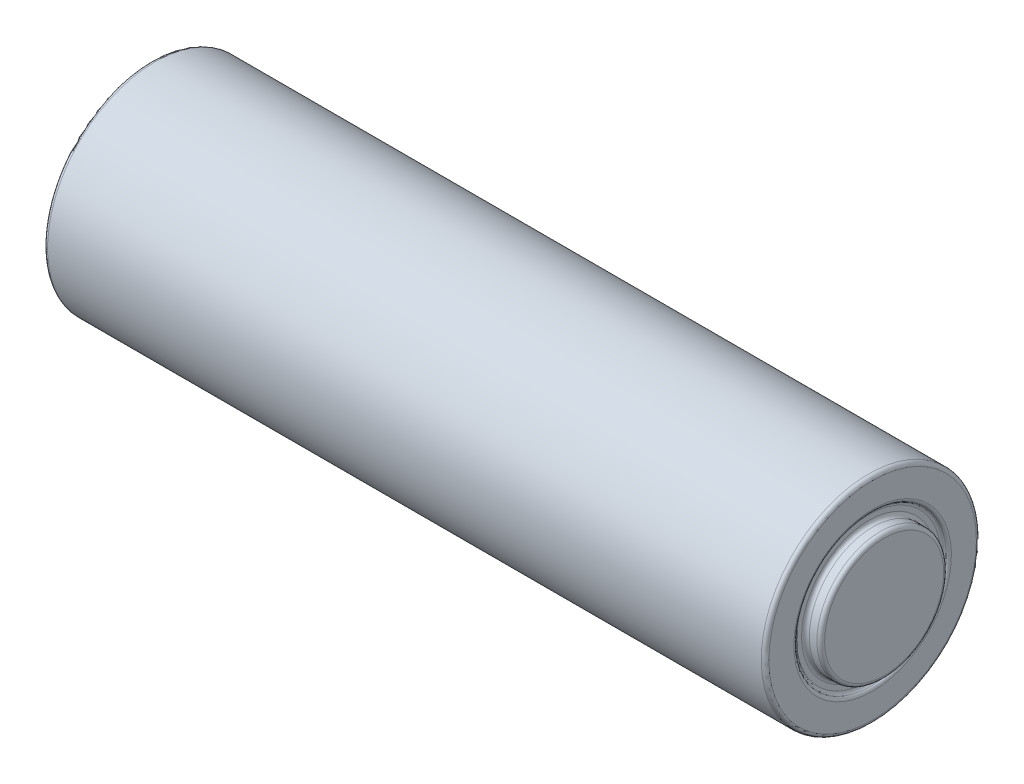
ISO-10303-21;
HEADER;
FILE_DESCRIPTION(('STEP AP214'),'2;1');
FILE_NAME('part.step','',(''),(''),'','','');
FILE_SCHEMA(('AUTOMOTIVE_DESIGN { 1 0 10303 214 1 1 1 1 }'));
ENDSEC;
DATA;
#1=APPLICATION_CONTEXT('core data for automotive mechanical design processes');
#2=APPLICATION_PROTOCOL_DEFINITION('international standard','automotive_design',2000,#1);
#3=PRODUCT_CONTEXT('',#1,'mechanical');
#4=PRODUCT('Part','Part','',(#3));
#5=PRODUCT_RELATED_PRODUCT_CATEGORY('part','',(#4));
#6=PRODUCT_DEFINITION_FORMATION('','',#4);
#7=PRODUCT_DEFINITION_CONTEXT('part definition',#1,'design');
#8=PRODUCT_DEFINITION('design','',#6,#7);
#9=PRODUCT_DEFINITION_SHAPE('','',#8);
#10=(LENGTH_UNIT() NAMED_UNIT(*) SI_UNIT(.MILLI.,.METRE.));
#11=(NAMED_UNIT(*) PLANE_ANGLE_UNIT() SI_UNIT($,.RADIAN.));
#12=(NAMED_UNIT(*) SI_UNIT($,.STERADIAN.) SOLID_ANGLE_UNIT());
#13=UNCERTAINTY_MEASURE_WITH_UNIT(LENGTH_MEASURE(1.E-05),#10,'distance_accuracy_value','');
#14=(GEOMETRIC_REPRESENTATION_CONTEXT(3) GLOBAL_UNCERTAINTY_ASSIGNED_CONTEXT((#13)) GLOBAL_UNIT_ASSIGNED_CONTEXT((#10,
#11,#12)) REPRESENTATION_CONTEXT('',''));
#15=CARTESIAN_POINT('',(0.,0.,0.));
#16=DIRECTION('',(0.,0.,1.));
#17=DIRECTION('',(1.,0.,0.));
#18=AXIS2_PLACEMENT_3D('',#15,#16,#17);
#19=CARTESIAN_POINT('',(47.4218,0.,0.));
#20=DIRECTION('',(1.,0.,0.));
#21=DIRECTION('',(0.,1.,0.));
#22=AXIS2_PLACEMENT_3D('',#19,#20,#21);
#23=PLANE('',#22);
#24=CARTESIAN_POINT('',(47.4218,0.,0.));
#25=DIRECTION('',(1.,0.,0.));
#26=DIRECTION('',(0.,1.,0.));
#27=AXIS2_PLACEMENT_3D('',#24,#25,#26);
#28=CIRCLE('',#27,4.7670590948775);
#29=CARTESIAN_POINT('',(47.4218,4.76705909487749,0.));
#30=VERTEX_POINT('',#29);
#31=EDGE_CURVE('E41',#30,#30,#28,.T.);
#32=ORIENTED_EDGE('',*,*,#31,.T.);
#33=EDGE_LOOP('',(#32));
#34=FACE_BOUND('',#33,.T.);
#35=CARTESIAN_POINT('',(47.4218,0.,0.));
#36=DIRECTION('',(1.,0.,0.));
#37=DIRECTION('',(0.,1.,0.));
#38=AXIS2_PLACEMENT_3D('',#35,#36,#37);
#39=CIRCLE('',#38,4.445);
#40=CARTESIAN_POINT('',(47.4218,4.44499999999999,0.));
#41=VERTEX_POINT('',#40);
#42=EDGE_CURVE('E45',#41,#41,#39,.F.);
#43=ORIENTED_EDGE('',*,*,#42,.T.);
#44=EDGE_LOOP('',(#43));
#45=FACE_BOUND('',#44,.T.);
#46=ADVANCED_FACE('F34',(#34,#45),#23,.T.);
#47=CARTESIAN_POINT('',(0.254,0.,0.));
#48=DIRECTION('',(-1.,0.,0.));
#49=DIRECTION('',(0.,-1.,0.));
#50=AXIS2_PLACEMENT_3D('',#47,#48,#49);
#51=PLANE('',#50);
#52=CARTESIAN_POINT('',(0.254,0.,0.));
#53=DIRECTION('',(-1.,0.,0.));
#54=DIRECTION('',(0.,-1.,0.));
#55=AXIS2_PLACEMENT_3D('',#52,#53,#54);
#56=CIRCLE('',#55,5.0718590948775);
#57=CARTESIAN_POINT('',(0.253999999999999,-5.0718590948775,0.));
#58=VERTEX_POINT('',#57);
#59=EDGE_CURVE('E72',#58,#58,#56,.T.);
#60=ORIENTED_EDGE('',*,*,#59,.T.);
#61=EDGE_LOOP('',(#60));
#62=FACE_BOUND('',#61,.T.);
#63=CARTESIAN_POINT('',(0.254,0.,0.));
#64=DIRECTION('',(-1.,0.,0.));
#65=DIRECTION('',(0.,-1.,0.));
#66=AXIS2_PLACEMENT_3D('',#63,#64,#65);
#67=CIRCLE('',#66,2.921);
#68=CARTESIAN_POINT('',(0.253999999999999,-2.921,0.));
#69=VERTEX_POINT('',#68);
#70=EDGE_CURVE('E75',#69,#69,#67,.F.);
#71=ORIENTED_EDGE('',*,*,#70,.T.);
#72=EDGE_LOOP('',(#71));
#73=FACE_BOUND('',#72,.T.);
#74=ADVANCED_FACE('F116',(#62,#73),#51,.T.);
#75=CARTESIAN_POINT('',(0.,7.11199999999999,0.));
#76=DIRECTION('',(1.,0.,0.));
#77=DIRECTION('',(0.,1.,0.));
#78=AXIS2_PLACEMENT_3D('',#75,#76,#77);
#79=PLANE('',#78);
#80=CARTESIAN_POINT('',(0.,0.,0.));
#81=DIRECTION('',(1.,0.,0.));
#82=DIRECTION('',(0.,1.,0.));
#83=AXIS2_PLACEMENT_3D('',#80,#81,#82);
#84=CIRCLE('',#83,6.858);
#85=CARTESIAN_POINT('',(0.,6.858,0.));
#86=VERTEX_POINT('',#85);
#87=EDGE_CURVE('E90',#86,#86,#84,.F.);
#88=ORIENTED_EDGE('',*,*,#87,.T.);
#89=EDGE_LOOP('',(#88));
#90=FACE_BOUND('',#89,.T.);
#91=CARTESIAN_POINT('',(0.,0.,0.));
#92=DIRECTION('',(1.,0.,0.));
#93=DIRECTION('',(0.,1.,0.));
#94=AXIS2_PLACEMENT_3D('',#91,#92,#93);
#95=CIRCLE('',#94,5.5118);
#96=CARTESIAN_POINT('',(0.,5.5118,0.));
#97=VERTEX_POINT('',#96);
#98=EDGE_CURVE('E93',#97,#97,#95,.T.);
#99=ORIENTED_EDGE('',*,*,#98,.T.);
#100=EDGE_LOOP('',(#99));
#101=FACE_BOUND('',#100,.T.);
#102=ADVANCED_FACE('F97',(#90,#101),#79,.F.);
#103=CARTESIAN_POINT('',(0.,0.,0.));
#104=DIRECTION('',(-1.,0.,0.));
#105=DIRECTION('',(0.,-1.,0.));
#106=AXIS2_PLACEMENT_3D('',#103,#104,#105);
#107=CYLINDRICAL_SURFACE('',#106,7.11199999999999);
#108=CARTESIAN_POINT('',(47.4218,0.,0.));
#109=DIRECTION('',(-1.,0.,0.));
#110=DIRECTION('',(0.,-1.,0.));
#111=AXIS2_PLACEMENT_3D('',#108,#109,#110);
#112=CIRCLE('',#111,7.11199999999999);
#113=CARTESIAN_POINT('',(47.4218,-7.11200000000001,0.));
#114=VERTEX_POINT('',#113);
#115=EDGE_CURVE('E66',#114,#114,#112,.T.);
#116=ORIENTED_EDGE('',*,*,#115,.T.);
#117=EDGE_LOOP('',(#116));
#118=FACE_BOUND('',#117,.T.);
#119=CARTESIAN_POINT('',(0.254,0.,0.));
#120=DIRECTION('',(1.,0.,0.));
#121=DIRECTION('',(0.,1.,0.));
#122=AXIS2_PLACEMENT_3D('',#119,#120,#121);
#123=CIRCLE('',#122,7.11199999999999);
#124=CARTESIAN_POINT('',(0.254000000000002,7.11199999999999,0.));
#125=VERTEX_POINT('',#124);
#126=EDGE_CURVE('E87',#125,#125,#123,.T.);
#127=ORIENTED_EDGE('',*,*,#126,.T.);
#128=EDGE_LOOP('',(#127));
#129=FACE_BOUND('',#128,.T.);
#130=ADVANCED_FACE('F139',(#118,#129),#107,.T.);
#131=CARTESIAN_POINT('',(47.6758,0.,0.));
#132=DIRECTION('',(-1.,0.,0.));
#133=DIRECTION('',(0.,-1.,0.));
#134=AXIS2_PLACEMENT_3D('',#131,#132,#133);
#135=PLANE('',#134);
#136=CARTESIAN_POINT('',(47.6758,0.,0.));
#137=DIRECTION('',(-1.,0.,0.));
#138=DIRECTION('',(0.,-1.,0.));
#139=AXIS2_PLACEMENT_3D('',#136,#137,#138);
#140=CIRCLE('',#139,6.858);
#141=CARTESIAN_POINT('',(47.6758,-6.85800000000001,0.));
#142=VERTEX_POINT('',#141);
#143=EDGE_CURVE('E60',#142,#142,#140,.F.);
#144=ORIENTED_EDGE('',*,*,#143,.T.);
#145=EDGE_LOOP('',(#144));
#146=FACE_BOUND('',#145,.T.);
#147=CARTESIAN_POINT('',(47.6758,0.,0.));
#148=DIRECTION('',(-1.,0.,0.));
#149=DIRECTION('',(0.,-1.,0.));
#150=AXIS2_PLACEMENT_3D('',#147,#148,#149);
#151=CIRCLE('',#150,5.207);
#152=CARTESIAN_POINT('',(47.6758,-5.20700000000001,0.));
#153=VERTEX_POINT('',#152);
#154=EDGE_CURVE('E63',#153,#153,#151,.T.);
#155=ORIENTED_EDGE('',*,*,#154,.T.);
#156=EDGE_LOOP('',(#155));
#157=FACE_BOUND('',#156,.T.);
#158=ADVANCED_FACE('F134',(#146,#157),#135,.F.);
#159=CARTESIAN_POINT('',(-1.27,0.,0.));
#160=DIRECTION('',(1.,0.,0.));
#161=DIRECTION('',(0.,1.,0.));
#162=AXIS2_PLACEMENT_3D('',#159,#160,#161);
#163=CYLINDRICAL_SURFACE('',#162,2.667);
#164=CARTESIAN_POINT('',(-1.016,0.,0.));
#165=DIRECTION('',(-1.,0.,0.));
#166=DIRECTION('',(0.,-1.,0.));
#167=AXIS2_PLACEMENT_3D('',#164,#165,#166);
#168=CIRCLE('',#167,2.667);
#169=CARTESIAN_POINT('',(-1.016,2.667,0.));
#170=VERTEX_POINT('',#169);
#171=EDGE_CURVE('E78',#170,#170,#168,.F.);
#172=CARTESIAN_POINT('',(0.,0.,0.));
#173=DIRECTION('',(-1.,0.,0.));
#174=DIRECTION('',(0.,-1.,0.));
#175=AXIS2_PLACEMENT_3D('',#172,#173,#174);
#176=CIRCLE('',#175,2.667);
#177=CARTESIAN_POINT('',(0.,2.667,0.));
#178=VERTEX_POINT('',#177);
#179=EDGE_CURVE('E81',#178,#178,#176,.T.);
#180=CARTESIAN_POINT('',(-1.016,2.667,0.));
#181=CARTESIAN_POINT('',(-1.00541666666667,2.667,0.));
#182=CARTESIAN_POINT('',(-0.994833333333333,2.667,0.));
#183=CARTESIAN_POINT('',(-0.973666666666666,2.667,0.));
#184=CARTESIAN_POINT('',(-0.963083333333333,2.667,0.));
#185=CARTESIAN_POINT('',(-0.941916666666666,2.667,0.));
#186=CARTESIAN_POINT('',(-0.931333333333333,2.667,0.));
#187=CARTESIAN_POINT('',(-0.910166666666666,2.667,0.));
#188=CARTESIAN_POINT('',(-0.899583333333333,2.667,0.));
#189=CARTESIAN_POINT('',(-0.878416666666666,2.667,0.));
#190=CARTESIAN_POINT('',(-0.867833333333333,2.667,0.));
#191=CARTESIAN_POINT('',(-0.846666666666666,2.667,0.));
#192=CARTESIAN_POINT('',(-0.836083333333333,2.667,0.));
#193=CARTESIAN_POINT('',(-0.814916666666666,2.667,0.));
#194=CARTESIAN_POINT('',(-0.804333333333333,2.667,0.));
#195=CARTESIAN_POINT('',(-0.783166666666666,2.667,0.));
#196=CARTESIAN_POINT('',(-0.772583333333333,2.667,0.));
#197=CARTESIAN_POINT('',(-0.751416666666666,2.667,0.));
#198=CARTESIAN_POINT('',(-0.740833333333333,2.667,0.));
#199=CARTESIAN_POINT('',(-0.719666666666666,2.667,0.));
#200=CARTESIAN_POINT('',(-0.709083333333333,2.667,0.));
#201=CARTESIAN_POINT('',(-0.687916666666666,2.667,0.));
#202=CARTESIAN_POINT('',(-0.677333333333333,2.667,0.));
#203=CARTESIAN_POINT('',(-0.656166666666666,2.667,0.));
#204=CARTESIAN_POINT('',(-0.645583333333333,2.667,0.));
#205=CARTESIAN_POINT('',(-0.624416666666666,2.667,0.));
#206=CARTESIAN_POINT('',(-0.613833333333333,2.667,0.));
#207=CARTESIAN_POINT('',(-0.592666666666666,2.667,0.));
#208=CARTESIAN_POINT('',(-0.582083333333333,2.667,0.));
#209=CARTESIAN_POINT('',(-0.560916666666666,2.667,0.));
#210=CARTESIAN_POINT('',(-0.550333333333333,2.667,0.));
#211=CARTESIAN_POINT('',(-0.529166666666666,2.667,0.));
#212=CARTESIAN_POINT('',(-0.518583333333333,2.667,0.));
#213=CARTESIAN_POINT('',(-0.497416666666666,2.667,0.));
#214=CARTESIAN_POINT('',(-0.486833333333333,2.667,0.));
#215=CARTESIAN_POINT('',(-0.465666666666666,2.667,0.));
#216=CARTESIAN_POINT('',(-0.455083333333333,2.667,0.));
#217=CARTESIAN_POINT('',(-0.433916666666666,2.667,0.));
#218=CARTESIAN_POINT('',(-0.423333333333333,2.667,0.));
#219=CARTESIAN_POINT('',(-0.402166666666666,2.667,0.));
#220=CARTESIAN_POINT('',(-0.391583333333333,2.667,0.));
#221=CARTESIAN_POINT('',(-0.370416666666666,2.667,0.));
#222=CARTESIAN_POINT('',(-0.359833333333333,2.667,0.));
#223=CARTESIAN_POINT('',(-0.338666666666666,2.667,0.));
#224=CARTESIAN_POINT('',(-0.328083333333333,2.667,0.));
#225=CARTESIAN_POINT('',(-0.306916666666666,2.667,0.));
#226=CARTESIAN_POINT('',(-0.296333333333333,2.667,0.));
#227=CARTESIAN_POINT('',(-0.275166666666666,2.667,0.));
#228=CARTESIAN_POINT('',(-0.264583333333333,2.667,0.));
#229=CARTESIAN_POINT('',(-0.243416666666666,2.667,0.));
#230=CARTESIAN_POINT('',(-0.232833333333333,2.667,0.));
#231=CARTESIAN_POINT('',(-0.211666666666666,2.667,0.));
#232=CARTESIAN_POINT('',(-0.201083333333333,2.667,0.));
#233=CARTESIAN_POINT('',(-0.179916666666666,2.667,0.));
#234=CARTESIAN_POINT('',(-0.169333333333333,2.667,0.));
#235=CARTESIAN_POINT('',(-0.148166666666666,2.667,0.));
#236=CARTESIAN_POINT('',(-0.137583333333333,2.667,0.));
#237=CARTESIAN_POINT('',(-0.116416666666666,2.667,0.));
#238=CARTESIAN_POINT('',(-0.105833333333333,2.667,0.));
#239=CARTESIAN_POINT('',(-0.0846666666666661,2.667,0.));
#240=CARTESIAN_POINT('',(-0.0740833333333328,2.667,0.));
#241=CARTESIAN_POINT('',(-0.0529166666666662,2.667,0.));
#242=CARTESIAN_POINT('',(-0.042333333333333,2.667,0.));
#243=CARTESIAN_POINT('',(-0.0211666666666663,2.667,0.));
#244=CARTESIAN_POINT('',(-0.0105833333333329,2.667,0.));
#245=CARTESIAN_POINT('',(0.,2.667,0.));
#246=B_SPLINE_CURVE_WITH_KNOTS('',3,(#180,#181,#182,#183,#184,#185,#186,#187,#188,#189,#190,
#191,#192,#193,#194,#195,#196,#197,#198,#199,#200,#201,#202,#203,#204,#205,#206,#207,#208,#209,
#210,#211,#212,#213,#214,#215,#216,#217,#218,#219,#220,#221,#222,#223,#224,#225,#226,#227,#228,
#229,#230,#231,#232,#233,#234,#235,#236,#237,#238,#239,#240,#241,#242,#243,#244,#245),
.UNSPECIFIED.,.F.,.F.,(4,2,2,2,2,2,2,2,2,2,2,2,2,2,2,2,2,2,2,2,2,2,2,2,2,2,2,2,2,2,2,2,4),(0.,
0.0317499999999999,0.0635,0.09525,0.127,0.15875,0.1905,0.22225,0.254,0.28575,0.3175,0.34925,
0.381,0.41275,0.4445,0.47625,0.508,0.53975,0.5715,0.60325,0.635,0.66675,0.6985,0.73025,0.762,
0.79375,0.8255,0.85725,0.889,0.92075,0.9525,0.98425,1.016),.UNSPECIFIED.);
#247=EDGE_CURVE('BSEAM131',#170,#178,#246,.T.);
#248=ORIENTED_EDGE('',*,*,#171,.T.);
#249=ORIENTED_EDGE('',*,*,#179,.T.);
#250=ORIENTED_EDGE('',*,*,#247,.T.);
#251=ORIENTED_EDGE('',*,*,#247,.F.);
#252=EDGE_LOOP('',(#248,#250,#249,#251));
#253=FACE_BOUND('',#252,.T.);
#254=ADVANCED_FACE('F131',(#253),#163,.T.);
#255=CARTESIAN_POINT('',(-1.27,0.,0.));
#256=DIRECTION('',(-1.,0.,0.));
#257=DIRECTION('',(0.,-1.,0.));
#258=AXIS2_PLACEMENT_3D('',#255,#256,#257);
#259=PLANE('',#258);
#260=CARTESIAN_POINT('',(-1.27,0.,0.));
#261=DIRECTION('',(-1.,0.,0.));
#262=DIRECTION('',(0.,-1.,0.));
#263=AXIS2_PLACEMENT_3D('',#260,#261,#262);
#264=CIRCLE('',#263,2.413);
#265=CARTESIAN_POINT('',(-1.27,-2.413,0.));
#266=VERTEX_POINT('',#265);
#267=EDGE_CURVE('E84',#266,#266,#264,.T.);
#268=ORIENTED_EDGE('',*,*,#267,.T.);
#269=EDGE_LOOP('',(#268));
#270=FACE_BOUND('',#269,.T.);
#271=ADVANCED_FACE('F128',(#270),#259,.T.);
#272=CARTESIAN_POINT('',(48.4378,0.,0.));
#273=DIRECTION('',(-1.,0.,0.));
#274=DIRECTION('',(0.,-1.,0.));
#275=AXIS2_PLACEMENT_3D('',#272,#273,#274);
#276=CYLINDRICAL_SURFACE('',#275,4.191);
#277=CARTESIAN_POINT('',(48.1838,0.,0.));
#278=DIRECTION('',(1.,0.,0.));
#279=DIRECTION('',(0.,1.,0.));
#280=AXIS2_PLACEMENT_3D('',#277,#278,#279);
#281=CIRCLE('',#280,4.191);
#282=CARTESIAN_POINT('',(48.1838,4.19099999999999,0.));
#283=VERTEX_POINT('',#282);
#284=EDGE_CURVE('E49',#283,#283,#281,.F.);
#285=ORIENTED_EDGE('',*,*,#284,.T.);
#286=EDGE_LOOP('',(#285));
#287=FACE_BOUND('',#286,.T.);
#288=CARTESIAN_POINT('',(47.6758,0.,0.));
#289=DIRECTION('',(1.,0.,0.));
#290=DIRECTION('',(0.,1.,0.));
#291=AXIS2_PLACEMENT_3D('',#288,#289,#290);
#292=CIRCLE('',#291,4.191);
#293=CARTESIAN_POINT('',(47.6758,4.19099999999999,0.));
#294=VERTEX_POINT('',#293);
#295=EDGE_CURVE('E54',#294,#294,#292,.T.);
#296=ORIENTED_EDGE('',*,*,#295,.T.);
#297=EDGE_LOOP('',(#296));
#298=FACE_BOUND('',#297,.T.);
#299=ADVANCED_FACE('F126',(#287,#298),#276,.T.);
#300=CARTESIAN_POINT('',(48.4378,0.,0.));
#301=DIRECTION('',(1.,0.,0.));
#302=DIRECTION('',(0.,1.,0.));
#303=AXIS2_PLACEMENT_3D('',#300,#301,#302);
#304=PLANE('',#303);
#305=CARTESIAN_POINT('',(48.4378,0.,0.));
#306=DIRECTION('',(1.,0.,0.));
#307=DIRECTION('',(0.,1.,0.));
#308=AXIS2_PLACEMENT_3D('',#305,#306,#307);
#309=CIRCLE('',#308,3.937);
#310=CARTESIAN_POINT('',(48.4378,3.93699999999999,0.));
#311=VERTEX_POINT('',#310);
#312=EDGE_CURVE('E57',#311,#311,#309,.T.);
#313=ORIENTED_EDGE('',*,*,#312,.T.);
#314=EDGE_LOOP('',(#313));
#315=FACE_BOUND('',#314,.T.);
#316=ADVANCED_FACE('F112',(#315),#304,.T.);
#317=CARTESIAN_POINT('',(0.254,0.,0.));
#318=DIRECTION('',(1.,0.,0.));
#319=DIRECTION('',(0.,1.,0.));
#320=AXIS2_PLACEMENT_3D('',#317,#318,#319);
#321=TOROIDAL_SURFACE('',#320,6.858,0.254);
#322=ORIENTED_EDGE('',*,*,#126,.F.);
#323=EDGE_LOOP('',(#322));
#324=FACE_BOUND('',#323,.T.);
#325=ORIENTED_EDGE('',*,*,#87,.F.);
#326=EDGE_LOOP('',(#325));
#327=FACE_BOUND('',#326,.T.);
#328=ADVANCED_FACE('F102',(#324,#327),#321,.T.);
#329=CARTESIAN_POINT('',(0.254,0.,0.));
#330=DIRECTION('',(1.,0.,0.));
#331=DIRECTION('',(0.,1.,0.));
#332=AXIS2_PLACEMENT_3D('',#329,#330,#331);
#333=TOROIDAL_SURFACE('',#332,5.5118,0.254);
#334=CARTESIAN_POINT('',(0.127000000000018,0.,0.));
#335=DIRECTION('',(1.,0.,0.));
#336=DIRECTION('',(0.,1.,0.));
#337=AXIS2_PLACEMENT_3D('',#334,#335,#336);
#338=CIRCLE('',#337,5.29182954743878);
#339=CARTESIAN_POINT('',(0.127000000000019,5.29182954743878,0.));
#340=VERTEX_POINT('',#339);
#341=EDGE_CURVE('E69',#340,#340,#338,.T.);
#342=ORIENTED_EDGE('',*,*,#341,.T.);
#343=EDGE_LOOP('',(#342));
#344=FACE_BOUND('',#343,.T.);
#345=ORIENTED_EDGE('',*,*,#98,.F.);
#346=EDGE_LOOP('',(#345));
#347=FACE_BOUND('',#346,.T.);
#348=ADVANCED_FACE('F99',(#344,#347),#333,.T.);
#349=CARTESIAN_POINT('',(-1.016,0.,0.));
#350=DIRECTION('',(-1.,0.,0.));
#351=DIRECTION('',(0.,-1.,0.));
#352=AXIS2_PLACEMENT_3D('',#349,#350,#351);
#353=TOROIDAL_SURFACE('',#352,2.413,0.254);
#354=ORIENTED_EDGE('',*,*,#171,.F.);
#355=EDGE_LOOP('',(#354));
#356=FACE_BOUND('',#355,.T.);
#357=ORIENTED_EDGE('',*,*,#267,.F.);
#358=EDGE_LOOP('',(#357));
#359=FACE_BOUND('',#358,.T.);
#360=ADVANCED_FACE('F101',(#356,#359),#353,.T.);
#361=CARTESIAN_POINT('',(0.,0.,0.));
#362=DIRECTION('',(-1.,0.,0.));
#363=DIRECTION('',(0.,-1.,0.));
#364=AXIS2_PLACEMENT_3D('',#361,#362,#363);
#365=TOROIDAL_SURFACE('',#364,2.921,0.254);
#366=ORIENTED_EDGE('',*,*,#70,.F.);
#367=EDGE_LOOP('',(#366));
#368=FACE_BOUND('',#367,.T.);
#369=ORIENTED_EDGE('',*,*,#179,.F.);
#370=EDGE_LOOP('',(#369));
#371=FACE_BOUND('',#370,.T.);
#372=ADVANCED_FACE('F109',(#368,#371),#365,.F.);
#373=CARTESIAN_POINT('',(0.,0.,0.));
#374=DIRECTION('',(1.,0.,0.));
#375=DIRECTION('',(0.,1.,0.));
#376=AXIS2_PLACEMENT_3D('',#373,#374,#375);
#377=TOROIDAL_SURFACE('',#376,5.0718590948775,0.254);
#378=ORIENTED_EDGE('',*,*,#341,.F.);
#379=EDGE_LOOP('',(#378));
#380=FACE_BOUND('',#379,.T.);
#381=ORIENTED_EDGE('',*,*,#59,.F.);
#382=EDGE_LOOP('',(#381));
#383=FACE_BOUND('',#382,.T.);
#384=ADVANCED_FACE('F201',(#380,#383),#377,.F.);
#385=CARTESIAN_POINT('',(47.4218,0.,0.));
#386=DIRECTION('',(-1.,0.,0.));
#387=DIRECTION('',(0.,-1.,0.));
#388=AXIS2_PLACEMENT_3D('',#385,#386,#387);
#389=TOROIDAL_SURFACE('',#388,6.858,0.254);
#390=ORIENTED_EDGE('',*,*,#143,.F.);
#391=EDGE_LOOP('',(#390));
#392=FACE_BOUND('',#391,.T.);
#393=ORIENTED_EDGE('',*,*,#115,.F.);
#394=EDGE_LOOP('',(#393));
#395=FACE_BOUND('',#394,.T.);
#396=ADVANCED_FACE('F217',(#392,#395),#389,.T.);
#397=CARTESIAN_POINT('',(47.4218,0.,0.));
#398=DIRECTION('',(-1.,0.,0.));
#399=DIRECTION('',(0.,-1.,0.));
#400=AXIS2_PLACEMENT_3D('',#397,#398,#399);
#401=TOROIDAL_SURFACE('',#400,5.207,0.254);
#402=CARTESIAN_POINT('',(47.5488,0.,0.));
#403=DIRECTION('',(-1.,0.,0.));
#404=DIRECTION('',(0.,-1.,0.));
#405=AXIS2_PLACEMENT_3D('',#402,#403,#404);
#406=CIRCLE('',#405,4.98702954743875);
#407=CARTESIAN_POINT('',(47.5488,-4.98702954743876,0.));
#408=VERTEX_POINT('',#407);
#409=EDGE_CURVE('E10',#408,#408,#406,.T.);
#410=ORIENTED_EDGE('',*,*,#409,.T.);
#411=EDGE_LOOP('',(#410));
#412=FACE_BOUND('',#411,.T.);
#413=ORIENTED_EDGE('',*,*,#154,.F.);
#414=EDGE_LOOP('',(#413));
#415=FACE_BOUND('',#414,.T.);
#416=ADVANCED_FACE('F227',(#412,#415),#401,.T.);
#417=CARTESIAN_POINT('',(48.1838,0.,0.));
#418=DIRECTION('',(1.,0.,0.));
#419=DIRECTION('',(0.,1.,0.));
#420=AXIS2_PLACEMENT_3D('',#417,#418,#419);
#421=TOROIDAL_SURFACE('',#420,3.937,0.254);
#422=ORIENTED_EDGE('',*,*,#284,.F.);
#423=EDGE_LOOP('',(#422));
#424=FACE_BOUND('',#423,.T.);
#425=ORIENTED_EDGE('',*,*,#312,.F.);
#426=EDGE_LOOP('',(#425));
#427=FACE_BOUND('',#426,.T.);
#428=ADVANCED_FACE('F235',(#424,#427),#421,.T.);
#429=CARTESIAN_POINT('',(47.6758,0.,0.));
#430=DIRECTION('',(1.,0.,0.));
#431=DIRECTION('',(0.,1.,0.));
#432=AXIS2_PLACEMENT_3D('',#429,#430,#431);
#433=TOROIDAL_SURFACE('',#432,4.445,0.254);
#434=ORIENTED_EDGE('',*,*,#42,.F.);
#435=EDGE_LOOP('',(#434));
#436=FACE_BOUND('',#435,.T.);
#437=ORIENTED_EDGE('',*,*,#295,.F.);
#438=EDGE_LOOP('',(#437));
#439=FACE_BOUND('',#438,.T.);
#440=ADVANCED_FACE('F242',(#436,#439),#433,.F.);
#441=CARTESIAN_POINT('',(47.6758,0.,0.));
#442=DIRECTION('',(-1.,0.,0.));
#443=DIRECTION('',(0.,-1.,0.));
#444=AXIS2_PLACEMENT_3D('',#441,#442,#443);
#445=TOROIDAL_SURFACE('',#444,4.7670590948775,0.254);
#446=ORIENTED_EDGE('',*,*,#409,.F.);
#447=EDGE_LOOP('',(#446));
#448=FACE_BOUND('',#447,.T.);
#449=ORIENTED_EDGE('',*,*,#31,.F.);
#450=EDGE_LOOP('',(#449));
#451=FACE_BOUND('',#450,.T.);
#452=ADVANCED_FACE('F36',(#448,#451),#445,.F.);
#453=CLOSED_SHELL('',(#46,#74,#102,#130,#158,#254,#271,#299,#316,#328,#348,#360,#372,#384,#396,
#416,#428,#440,#452));
#454=MANIFOLD_SOLID_BREP('B2',#453);
#455=ADVANCED_BREP_SHAPE_REPRESENTATION('',(#18,#454),#14);
#456=SHAPE_DEFINITION_REPRESENTATION(#9,#455);
ENDSEC;
END-ISO-10303-21;
